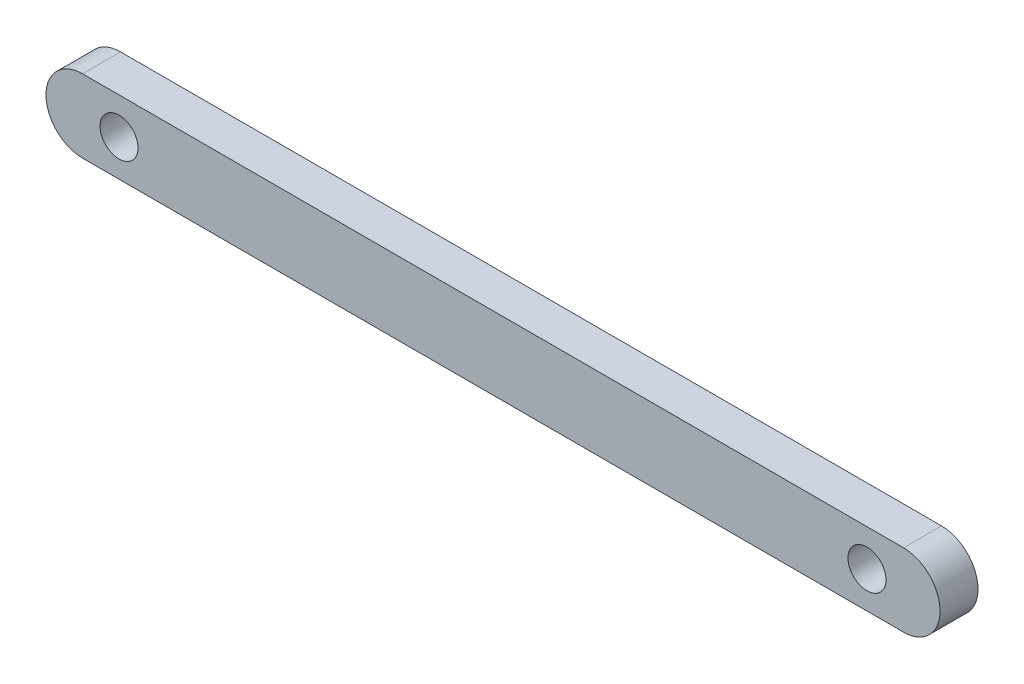
ISO-10303-21;
HEADER;
FILE_DESCRIPTION(('STEP AP214'),'2;1');
FILE_NAME('part.step','',(''),(''),'','','');
FILE_SCHEMA(('AUTOMOTIVE_DESIGN { 1 0 10303 214 1 1 1 1 }'));
ENDSEC;
DATA;
#1=APPLICATION_CONTEXT('core data for automotive mechanical design processes');
#2=APPLICATION_PROTOCOL_DEFINITION('international standard','automotive_design',2000,#1);
#3=PRODUCT_CONTEXT('',#1,'mechanical');
#4=PRODUCT('Part','Part','',(#3));
#5=PRODUCT_RELATED_PRODUCT_CATEGORY('part','',(#4));
#6=PRODUCT_DEFINITION_FORMATION('','',#4);
#7=PRODUCT_DEFINITION_CONTEXT('part definition',#1,'design');
#8=PRODUCT_DEFINITION('design','',#6,#7);
#9=PRODUCT_DEFINITION_SHAPE('','',#8);
#10=(LENGTH_UNIT() NAMED_UNIT(*) SI_UNIT(.MILLI.,.METRE.));
#11=(NAMED_UNIT(*) PLANE_ANGLE_UNIT() SI_UNIT($,.RADIAN.));
#12=(NAMED_UNIT(*) SI_UNIT($,.STERADIAN.) SOLID_ANGLE_UNIT());
#13=UNCERTAINTY_MEASURE_WITH_UNIT(LENGTH_MEASURE(1.E-05),#10,'distance_accuracy_value','');
#14=(GEOMETRIC_REPRESENTATION_CONTEXT(3) GLOBAL_UNCERTAINTY_ASSIGNED_CONTEXT((#13)) GLOBAL_UNIT_ASSIGNED_CONTEXT((#10,
#11,#12)) REPRESENTATION_CONTEXT('',''));
#15=CARTESIAN_POINT('',(0.,0.,0.));
#16=DIRECTION('',(0.,0.,1.));
#17=DIRECTION('',(1.,0.,0.));
#18=AXIS2_PLACEMENT_3D('',#15,#16,#17);
#19=CARTESIAN_POINT('',(35.687,0.,-3.302));
#20=DIRECTION('',(0.,0.,1.));
#21=DIRECTION('',(1.,0.,0.));
#22=AXIS2_PLACEMENT_3D('',#19,#20,#21);
#23=CYLINDRICAL_SURFACE('',#22,3.175);
#24=CARTESIAN_POINT('',(35.687,0.,0.));
#25=DIRECTION('',(0.,0.,1.));
#26=DIRECTION('',(1.,0.,0.));
#27=AXIS2_PLACEMENT_3D('',#24,#25,#26);
#28=CIRCLE('',#27,3.175);
#29=CARTESIAN_POINT('',(35.687,-3.175,0.));
#30=VERTEX_POINT('',#29);
#31=CARTESIAN_POINT('',(35.687,3.175,0.));
#32=VERTEX_POINT('',#31);
#33=EDGE_CURVE('E99',#30,#32,#28,.T.);
#34=ORIENTED_EDGE('',*,*,#33,.F.);
#35=DIRECTION('',(0.,0.,1.));
#36=VECTOR('',#35,1.);
#37=CARTESIAN_POINT('',(35.687,-3.175,-3.302));
#38=LINE('',#37,#36);
#39=CARTESIAN_POINT('',(35.687,-3.175,-3.302));
#40=VERTEX_POINT('',#39);
#41=EDGE_CURVE('E11',#40,#30,#38,.T.);
#42=ORIENTED_EDGE('',*,*,#41,.F.);
#43=CARTESIAN_POINT('',(35.687,0.,-3.302));
#44=DIRECTION('',(0.,0.,1.));
#45=DIRECTION('',(1.,0.,0.));
#46=AXIS2_PLACEMENT_3D('',#43,#44,#45);
#47=CIRCLE('',#46,3.175);
#48=CARTESIAN_POINT('',(35.687,3.175,-3.302));
#49=VERTEX_POINT('',#48);
#50=EDGE_CURVE('E92',#40,#49,#47,.T.);
#51=ORIENTED_EDGE('',*,*,#50,.T.);
#52=DIRECTION('',(0.,0.,1.));
#53=VECTOR('',#52,1.);
#54=CARTESIAN_POINT('',(35.687,3.175,-3.302));
#55=LINE('',#54,#53);
#56=EDGE_CURVE('E37',#49,#32,#55,.T.);
#57=ORIENTED_EDGE('',*,*,#56,.T.);
#58=EDGE_LOOP('',(#34,#42,#51,#57));
#59=FACE_BOUND('',#58,.T.);
#60=ADVANCED_FACE('F34',(#59),#23,.T.);
#61=CARTESIAN_POINT('',(35.687,-3.175,-3.302));
#62=DIRECTION('',(0.,-1.,0.));
#63=DIRECTION('',(1.,0.,0.));
#64=AXIS2_PLACEMENT_3D('',#61,#62,#63);
#65=PLANE('',#64);
#66=DIRECTION('',(1.,0.,0.));
#67=VECTOR('',#66,1.);
#68=CARTESIAN_POINT('',(35.687,-3.175,0.));
#69=LINE('',#68,#67);
#70=CARTESIAN_POINT('',(-35.687,-3.17500000000001,0.));
#71=VERTEX_POINT('',#70);
#72=EDGE_CURVE('E94',#71,#30,#69,.T.);
#73=ORIENTED_EDGE('',*,*,#72,.F.);
#74=DIRECTION('',(0.,0.,1.));
#75=VECTOR('',#74,1.);
#76=CARTESIAN_POINT('',(-35.687,-3.17500000000001,-3.302));
#77=LINE('',#76,#75);
#78=CARTESIAN_POINT('',(-35.687,-3.17500000000001,-3.302));
#79=VERTEX_POINT('',#78);
#80=EDGE_CURVE('E43',#79,#71,#77,.T.);
#81=ORIENTED_EDGE('',*,*,#80,.F.);
#82=DIRECTION('',(1.,0.,0.));
#83=VECTOR('',#82,1.);
#84=CARTESIAN_POINT('',(35.687,-3.175,-3.302));
#85=LINE('',#84,#83);
#86=EDGE_CURVE('E89',#79,#40,#85,.T.);
#87=ORIENTED_EDGE('',*,*,#86,.T.);
#88=ORIENTED_EDGE('',*,*,#41,.T.);
#89=EDGE_LOOP('',(#73,#81,#87,#88));
#90=FACE_BOUND('',#89,.T.);
#91=ADVANCED_FACE('F110',(#90),#65,.T.);
#92=CARTESIAN_POINT('',(-35.687,0.,-3.302));
#93=DIRECTION('',(0.,0.,1.));
#94=DIRECTION('',(1.,0.,0.));
#95=AXIS2_PLACEMENT_3D('',#92,#93,#94);
#96=CYLINDRICAL_SURFACE('',#95,3.175);
#97=CARTESIAN_POINT('',(-35.687,0.,0.));
#98=DIRECTION('',(0.,0.,1.));
#99=DIRECTION('',(1.,0.,0.));
#100=AXIS2_PLACEMENT_3D('',#97,#98,#99);
#101=CIRCLE('',#100,3.175);
#102=CARTESIAN_POINT('',(-35.687,3.17499999999999,0.));
#103=VERTEX_POINT('',#102);
#104=EDGE_CURVE('E84',#103,#71,#101,.T.);
#105=ORIENTED_EDGE('',*,*,#104,.F.);
#106=DIRECTION('',(0.,0.,1.));
#107=VECTOR('',#106,1.);
#108=CARTESIAN_POINT('',(-35.687,3.17499999999999,-3.302));
#109=LINE('',#108,#107);
#110=CARTESIAN_POINT('',(-35.687,3.17499999999999,-3.302));
#111=VERTEX_POINT('',#110);
#112=EDGE_CURVE('E79',#111,#103,#109,.T.);
#113=ORIENTED_EDGE('',*,*,#112,.F.);
#114=CARTESIAN_POINT('',(-35.687,0.,-3.302));
#115=DIRECTION('',(0.,0.,1.));
#116=DIRECTION('',(1.,0.,0.));
#117=AXIS2_PLACEMENT_3D('',#114,#115,#116);
#118=CIRCLE('',#117,3.175);
#119=EDGE_CURVE('E82',#111,#79,#118,.T.);
#120=ORIENTED_EDGE('',*,*,#119,.T.);
#121=ORIENTED_EDGE('',*,*,#80,.T.);
#122=EDGE_LOOP('',(#105,#113,#120,#121));
#123=FACE_BOUND('',#122,.T.);
#124=ADVANCED_FACE('F81',(#123),#96,.T.);
#125=CARTESIAN_POINT('',(35.687,3.175,-3.302));
#126=DIRECTION('',(0.,1.,0.));
#127=DIRECTION('',(-1.,0.,0.));
#128=AXIS2_PLACEMENT_3D('',#125,#126,#127);
#129=PLANE('',#128);
#130=DIRECTION('',(-1.,0.,0.));
#131=VECTOR('',#130,1.);
#132=CARTESIAN_POINT('',(35.687,3.175,0.));
#133=LINE('',#132,#131);
#134=EDGE_CURVE('E102',#32,#103,#133,.T.);
#135=ORIENTED_EDGE('',*,*,#134,.F.);
#136=ORIENTED_EDGE('',*,*,#56,.F.);
#137=DIRECTION('',(-1.,0.,0.));
#138=VECTOR('',#137,1.);
#139=CARTESIAN_POINT('',(35.687,3.175,-3.302));
#140=LINE('',#139,#138);
#141=EDGE_CURVE('E88',#49,#111,#140,.T.);
#142=ORIENTED_EDGE('',*,*,#141,.T.);
#143=ORIENTED_EDGE('',*,*,#112,.T.);
#144=EDGE_LOOP('',(#135,#136,#142,#143));
#145=FACE_BOUND('',#144,.T.);
#146=ADVANCED_FACE('F91',(#145),#129,.T.);
#147=CARTESIAN_POINT('',(35.687,0.,-3.302));
#148=DIRECTION('',(0.,0.,1.));
#149=DIRECTION('',(1.,0.,0.));
#150=AXIS2_PLACEMENT_3D('',#147,#148,#149);
#151=PLANE('',#150);
#152=CARTESIAN_POINT('',(-32.512,0.,-3.302));
#153=DIRECTION('',(0.,0.,1.));
#154=DIRECTION('',(1.,0.,0.));
#155=AXIS2_PLACEMENT_3D('',#152,#153,#154);
#156=CIRCLE('',#155,1.651);
#157=CARTESIAN_POINT('',(-30.861,0.,-3.302));
#158=VERTEX_POINT('',#157);
#159=EDGE_CURVE('E143',#158,#158,#156,.T.);
#160=ORIENTED_EDGE('',*,*,#159,.T.);
#161=EDGE_LOOP('',(#160));
#162=FACE_BOUND('',#161,.T.);
#163=CARTESIAN_POINT('',(32.512,0.,-3.302));
#164=DIRECTION('',(0.,0.,1.));
#165=DIRECTION('',(1.,0.,0.));
#166=AXIS2_PLACEMENT_3D('',#163,#164,#165);
#167=CIRCLE('',#166,1.651);
#168=CARTESIAN_POINT('',(34.163,0.,-3.302));
#169=VERTEX_POINT('',#168);
#170=EDGE_CURVE('E103',#169,#169,#167,.T.);
#171=ORIENTED_EDGE('',*,*,#170,.T.);
#172=EDGE_LOOP('',(#171));
#173=FACE_BOUND('',#172,.T.);
#174=ORIENTED_EDGE('',*,*,#50,.F.);
#175=ORIENTED_EDGE('',*,*,#86,.F.);
#176=ORIENTED_EDGE('',*,*,#119,.F.);
#177=ORIENTED_EDGE('',*,*,#141,.F.);
#178=EDGE_LOOP('',(#174,#175,#176,#177));
#179=FACE_BOUND('',#178,.T.);
#180=ADVANCED_FACE('F87',(#162,#173,#179),#151,.F.);
#181=CARTESIAN_POINT('',(35.687,0.,0.));
#182=DIRECTION('',(0.,0.,1.));
#183=DIRECTION('',(1.,0.,0.));
#184=AXIS2_PLACEMENT_3D('',#181,#182,#183);
#185=PLANE('',#184);
#186=CARTESIAN_POINT('',(-32.512,0.,0.));
#187=DIRECTION('',(0.,0.,1.));
#188=DIRECTION('',(1.,0.,0.));
#189=AXIS2_PLACEMENT_3D('',#186,#187,#188);
#190=CIRCLE('',#189,1.651);
#191=CARTESIAN_POINT('',(-30.861,0.,0.));
#192=VERTEX_POINT('',#191);
#193=EDGE_CURVE('E146',#192,#192,#190,.T.);
#194=ORIENTED_EDGE('',*,*,#193,.F.);
#195=EDGE_LOOP('',(#194));
#196=FACE_BOUND('',#195,.T.);
#197=CARTESIAN_POINT('',(32.512,0.,0.));
#198=DIRECTION('',(0.,0.,1.));
#199=DIRECTION('',(1.,0.,0.));
#200=AXIS2_PLACEMENT_3D('',#197,#198,#199);
#201=CIRCLE('',#200,1.651);
#202=CARTESIAN_POINT('',(34.163,0.,0.));
#203=VERTEX_POINT('',#202);
#204=EDGE_CURVE('E148',#203,#203,#201,.T.);
#205=ORIENTED_EDGE('',*,*,#204,.F.);
#206=EDGE_LOOP('',(#205));
#207=FACE_BOUND('',#206,.T.);
#208=ORIENTED_EDGE('',*,*,#33,.T.);
#209=ORIENTED_EDGE('',*,*,#134,.T.);
#210=ORIENTED_EDGE('',*,*,#104,.T.);
#211=ORIENTED_EDGE('',*,*,#72,.T.);
#212=EDGE_LOOP('',(#208,#209,#210,#211));
#213=FACE_BOUND('',#212,.T.);
#214=ADVANCED_FACE('F109',(#196,#207,#213),#185,.T.);
#215=CARTESIAN_POINT('',(32.512,0.,0.));
#216=DIRECTION('',(0.,0.,1.));
#217=DIRECTION('',(1.,0.,0.));
#218=AXIS2_PLACEMENT_3D('',#215,#216,#217);
#219=CYLINDRICAL_SURFACE('',#218,1.651);
#220=ORIENTED_EDGE('',*,*,#170,.F.);
#221=EDGE_LOOP('',(#220));
#222=FACE_BOUND('',#221,.T.);
#223=ORIENTED_EDGE('',*,*,#204,.T.);
#224=EDGE_LOOP('',(#223));
#225=FACE_BOUND('',#224,.T.);
#226=ADVANCED_FACE('F128',(#222,#225),#219,.F.);
#227=CARTESIAN_POINT('',(-32.512,0.,0.));
#228=DIRECTION('',(0.,0.,1.));
#229=DIRECTION('',(1.,0.,0.));
#230=AXIS2_PLACEMENT_3D('',#227,#228,#229);
#231=CYLINDRICAL_SURFACE('',#230,1.651);
#232=ORIENTED_EDGE('',*,*,#159,.F.);
#233=EDGE_LOOP('',(#232));
#234=FACE_BOUND('',#233,.T.);
#235=ORIENTED_EDGE('',*,*,#193,.T.);
#236=EDGE_LOOP('',(#235));
#237=FACE_BOUND('',#236,.T.);
#238=ADVANCED_FACE('F135',(#234,#237),#231,.F.);
#239=CLOSED_SHELL('',(#60,#91,#124,#146,#180,#214,#226,#238));
#240=MANIFOLD_SOLID_BREP('B2',#239);
#241=ADVANCED_BREP_SHAPE_REPRESENTATION('',(#18,#240),#14);
#242=SHAPE_DEFINITION_REPRESENTATION(#9,#241);
ENDSEC;
END-ISO-10303-21;
